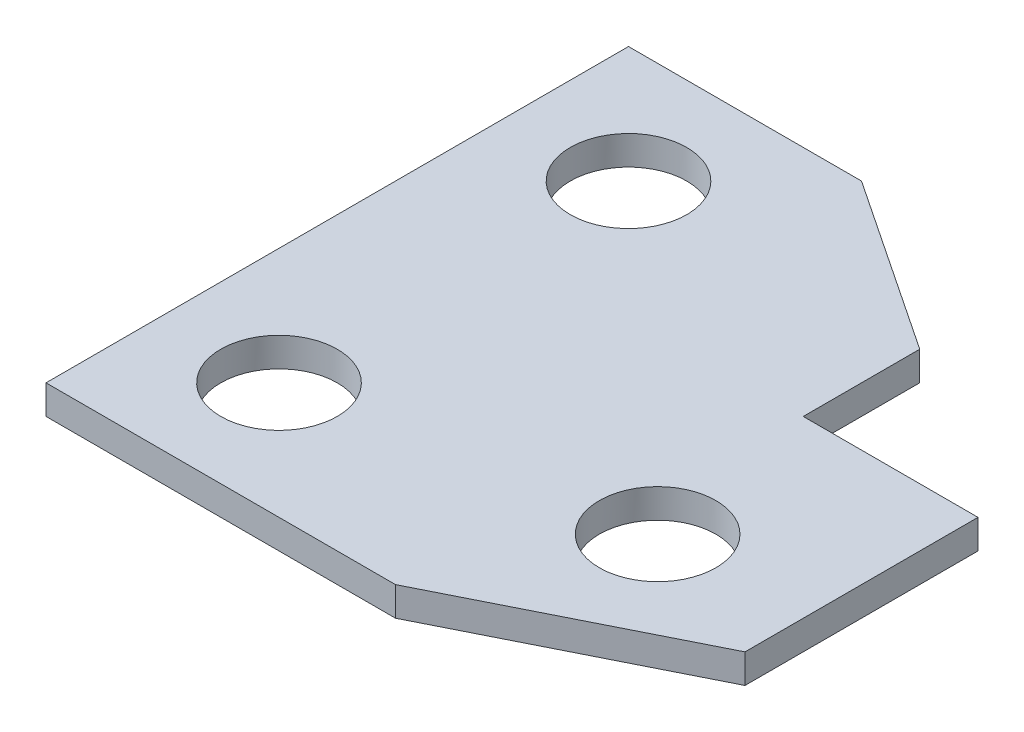
ISO-10303-21;
HEADER;
FILE_DESCRIPTION(('STEP AP214'),'2;1');
FILE_NAME('part.step','',(''),(''),'','','');
FILE_SCHEMA(('AUTOMOTIVE_DESIGN { 1 0 10303 214 1 1 1 1 }'));
ENDSEC;
DATA;
#1=APPLICATION_CONTEXT('core data for automotive mechanical design processes');
#2=APPLICATION_PROTOCOL_DEFINITION('international standard','automotive_design',2000,#1);
#3=PRODUCT_CONTEXT('',#1,'mechanical');
#4=PRODUCT('Part','Part','',(#3));
#5=PRODUCT_RELATED_PRODUCT_CATEGORY('part','',(#4));
#6=PRODUCT_DEFINITION_FORMATION('','',#4);
#7=PRODUCT_DEFINITION_CONTEXT('part definition',#1,'design');
#8=PRODUCT_DEFINITION('design','',#6,#7);
#9=PRODUCT_DEFINITION_SHAPE('','',#8);
#10=(LENGTH_UNIT() NAMED_UNIT(*) SI_UNIT(.MILLI.,.METRE.));
#11=(NAMED_UNIT(*) PLANE_ANGLE_UNIT() SI_UNIT($,.RADIAN.));
#12=(NAMED_UNIT(*) SI_UNIT($,.STERADIAN.) SOLID_ANGLE_UNIT());
#13=UNCERTAINTY_MEASURE_WITH_UNIT(LENGTH_MEASURE(1.E-05),#10,'distance_accuracy_value','');
#14=(GEOMETRIC_REPRESENTATION_CONTEXT(3) GLOBAL_UNCERTAINTY_ASSIGNED_CONTEXT((#13)) GLOBAL_UNIT_ASSIGNED_CONTEXT((#10,
#11,#12)) REPRESENTATION_CONTEXT('',''));
#15=CARTESIAN_POINT('',(0.,0.,0.));
#16=DIRECTION('',(0.,0.,1.));
#17=DIRECTION('',(1.,0.,0.));
#18=AXIS2_PLACEMENT_3D('',#15,#16,#17);
#19=CARTESIAN_POINT('',(72.8358998807466,5.,8.85943655601248));
#20=DIRECTION('',(0.,0.,1.));
#21=DIRECTION('',(1.,0.,0.));
#22=AXIS2_PLACEMENT_3D('',#19,#20,#21);
#23=PLANE('',#22);
#24=DIRECTION('',(-1.,0.,0.));
#25=VECTOR('',#24,1.);
#26=CARTESIAN_POINT('',(72.8358998807466,0.,8.85943655601248));
#27=LINE('',#26,#25);
#28=CARTESIAN_POINT('',(72.8358998807466,0.,8.85943655601248));
#29=VERTEX_POINT('',#28);
#30=CARTESIAN_POINT('',(42.8358998807466,0.,8.85943655601248));
#31=VERTEX_POINT('',#30);
#32=EDGE_CURVE('E145',#29,#31,#27,.T.);
#33=ORIENTED_EDGE('',*,*,#32,.T.);
#34=DIRECTION('',(0.,-1.,0.));
#35=VECTOR('',#34,1.);
#36=CARTESIAN_POINT('',(42.8358998807466,5.,8.85943655601248));
#37=LINE('',#36,#35);
#38=CARTESIAN_POINT('',(42.8358998807466,5.,8.85943655601248));
#39=VERTEX_POINT('',#38);
#40=EDGE_CURVE('E11',#39,#31,#37,.T.);
#41=ORIENTED_EDGE('',*,*,#40,.F.);
#42=DIRECTION('',(-1.,0.,0.));
#43=VECTOR('',#42,1.);
#44=CARTESIAN_POINT('',(72.8358998807466,5.,8.85943655601248));
#45=LINE('',#44,#43);
#46=CARTESIAN_POINT('',(72.8358998807466,5.,8.85943655601248));
#47=VERTEX_POINT('',#46);
#48=EDGE_CURVE('E167',#47,#39,#45,.T.);
#49=ORIENTED_EDGE('',*,*,#48,.F.);
#50=DIRECTION('',(0.,-1.,0.));
#51=VECTOR('',#50,1.);
#52=CARTESIAN_POINT('',(72.8358998807466,5.,8.85943655601248));
#53=LINE('',#52,#51);
#54=EDGE_CURVE('E141',#47,#29,#53,.T.);
#55=ORIENTED_EDGE('',*,*,#54,.T.);
#56=EDGE_LOOP('',(#33,#41,#49,#55));
#57=FACE_BOUND('',#56,.T.);
#58=ADVANCED_FACE('F42',(#57),#23,.F.);
#59=CARTESIAN_POINT('',(42.8358998807466,5.,8.85943655601248));
#60=DIRECTION('',(-1.,0.,0.));
#61=DIRECTION('',(0.,0.,1.));
#62=AXIS2_PLACEMENT_3D('',#59,#60,#61);
#63=PLANE('',#62);
#64=DIRECTION('',(0.,0.,-1.));
#65=VECTOR('',#64,1.);
#66=CARTESIAN_POINT('',(42.8358998807466,0.,8.85943655601248));
#67=LINE('',#66,#65);
#68=CARTESIAN_POINT('',(42.8358998807466,0.,-11.1405634439875));
#69=VERTEX_POINT('',#68);
#70=EDGE_CURVE('E149',#31,#69,#67,.T.);
#71=ORIENTED_EDGE('',*,*,#70,.T.);
#72=DIRECTION('',(0.,-1.,0.));
#73=VECTOR('',#72,1.);
#74=CARTESIAN_POINT('',(42.8358998807466,5.,-11.1405634439875));
#75=LINE('',#74,#73);
#76=CARTESIAN_POINT('',(42.8358998807466,5.,-11.1405634439875));
#77=VERTEX_POINT('',#76);
#78=EDGE_CURVE('E52',#77,#69,#75,.T.);
#79=ORIENTED_EDGE('',*,*,#78,.F.);
#80=DIRECTION('',(0.,0.,-1.));
#81=VECTOR('',#80,1.);
#82=CARTESIAN_POINT('',(42.8358998807466,5.,8.85943655601248));
#83=LINE('',#82,#81);
#84=EDGE_CURVE('E104',#39,#77,#83,.T.);
#85=ORIENTED_EDGE('',*,*,#84,.F.);
#86=ORIENTED_EDGE('',*,*,#40,.T.);
#87=EDGE_LOOP('',(#71,#79,#85,#86));
#88=FACE_BOUND('',#87,.T.);
#89=ADVANCED_FACE('F225',(#88),#63,.F.);
#90=CARTESIAN_POINT('',(42.8358998807466,5.,-11.1405634439875));
#91=DIRECTION('',(-0.554700196225229,0.,0.832050294337844));
#92=DIRECTION('',(0.832050294337844,0.,0.554700196225229));
#93=AXIS2_PLACEMENT_3D('',#90,#91,#92);
#94=PLANE('',#93);
#95=DIRECTION('',(-0.832050294337844,0.,-0.554700196225229));
#96=VECTOR('',#95,1.);
#97=CARTESIAN_POINT('',(42.8358998807466,0.,-11.1405634439875));
#98=LINE('',#97,#96);
#99=CARTESIAN_POINT('',(12.8358998807466,0.,-31.1405634439875));
#100=VERTEX_POINT('',#99);
#101=EDGE_CURVE('E152',#69,#100,#98,.T.);
#102=ORIENTED_EDGE('',*,*,#101,.T.);
#103=DIRECTION('',(0.,-1.,0.));
#104=VECTOR('',#103,1.);
#105=CARTESIAN_POINT('',(12.8358998807466,5.,-31.1405634439875));
#106=LINE('',#105,#104);
#107=CARTESIAN_POINT('',(12.8358998807466,5.,-31.1405634439875));
#108=VERTEX_POINT('',#107);
#109=EDGE_CURVE('E178',#108,#100,#106,.T.);
#110=ORIENTED_EDGE('',*,*,#109,.F.);
#111=DIRECTION('',(-0.832050294337844,0.,-0.554700196225229));
#112=VECTOR('',#111,1.);
#113=CARTESIAN_POINT('',(42.8358998807466,5.,-11.1405634439875));
#114=LINE('',#113,#112);
#115=EDGE_CURVE('E370',#77,#108,#114,.T.);
#116=ORIENTED_EDGE('',*,*,#115,.F.);
#117=ORIENTED_EDGE('',*,*,#78,.T.);
#118=EDGE_LOOP('',(#102,#110,#116,#117));
#119=FACE_BOUND('',#118,.T.);
#120=ADVANCED_FACE('F229',(#119),#94,.F.);
#121=CARTESIAN_POINT('',(12.8358998807466,5.,-31.1405634439875));
#122=DIRECTION('',(0.,0.,1.));
#123=DIRECTION('',(1.,0.,0.));
#124=AXIS2_PLACEMENT_3D('',#121,#122,#123);
#125=PLANE('',#124);
#126=DIRECTION('',(-1.,0.,0.));
#127=VECTOR('',#126,1.);
#128=CARTESIAN_POINT('',(12.8358998807466,0.,-31.1405634439875));
#129=LINE('',#128,#127);
#130=CARTESIAN_POINT('',(-27.1641001192534,0.,-31.1405634439875));
#131=VERTEX_POINT('',#130);
#132=EDGE_CURVE('E155',#100,#131,#129,.T.);
#133=ORIENTED_EDGE('',*,*,#132,.T.);
#134=DIRECTION('',(0.,-1.,0.));
#135=VECTOR('',#134,1.);
#136=CARTESIAN_POINT('',(-27.1641001192534,5.,-31.1405634439875));
#137=LINE('',#136,#135);
#138=CARTESIAN_POINT('',(-27.1641001192534,5.,-31.1405634439875));
#139=VERTEX_POINT('',#138);
#140=EDGE_CURVE('E174',#139,#131,#137,.T.);
#141=ORIENTED_EDGE('',*,*,#140,.F.);
#142=DIRECTION('',(-1.,0.,0.));
#143=VECTOR('',#142,1.);
#144=CARTESIAN_POINT('',(12.8358998807466,5.,-31.1405634439875));
#145=LINE('',#144,#143);
#146=EDGE_CURVE('E373',#108,#139,#145,.T.);
#147=ORIENTED_EDGE('',*,*,#146,.F.);
#148=ORIENTED_EDGE('',*,*,#109,.T.);
#149=EDGE_LOOP('',(#133,#141,#147,#148));
#150=FACE_BOUND('',#149,.T.);
#151=ADVANCED_FACE('F233',(#150),#125,.F.);
#152=CARTESIAN_POINT('',(-27.1641001192534,5.,-31.1405634439875));
#153=DIRECTION('',(1.,0.,0.));
#154=DIRECTION('',(0.,0.,-1.));
#155=AXIS2_PLACEMENT_3D('',#152,#153,#154);
#156=PLANE('',#155);
#157=DIRECTION('',(0.,0.,1.));
#158=VECTOR('',#157,1.);
#159=CARTESIAN_POINT('',(-27.1641001192534,0.,-31.1405634439875));
#160=LINE('',#159,#158);
#161=CARTESIAN_POINT('',(-27.1641001192534,0.,68.8594365560125));
#162=VERTEX_POINT('',#161);
#163=EDGE_CURVE('E158',#131,#162,#160,.T.);
#164=ORIENTED_EDGE('',*,*,#163,.T.);
#165=DIRECTION('',(0.,-1.,0.));
#166=VECTOR('',#165,1.);
#167=CARTESIAN_POINT('',(-27.1641001192534,5.,68.8594365560125));
#168=LINE('',#167,#166);
#169=CARTESIAN_POINT('',(-27.1641001192534,5.,68.8594365560125));
#170=VERTEX_POINT('',#169);
#171=EDGE_CURVE('E134',#170,#162,#168,.T.);
#172=ORIENTED_EDGE('',*,*,#171,.F.);
#173=DIRECTION('',(0.,0.,1.));
#174=VECTOR('',#173,1.);
#175=CARTESIAN_POINT('',(-27.1641001192534,5.,-31.1405634439875));
#176=LINE('',#175,#174);
#177=EDGE_CURVE('E123',#139,#170,#176,.T.);
#178=ORIENTED_EDGE('',*,*,#177,.F.);
#179=ORIENTED_EDGE('',*,*,#140,.T.);
#180=EDGE_LOOP('',(#164,#172,#178,#179));
#181=FACE_BOUND('',#180,.T.);
#182=ADVANCED_FACE('F239',(#181),#156,.F.);
#183=CARTESIAN_POINT('',(-27.1641001192534,5.,68.8594365560125));
#184=DIRECTION('',(0.,0.,-1.));
#185=DIRECTION('',(-1.,0.,0.));
#186=AXIS2_PLACEMENT_3D('',#183,#184,#185);
#187=PLANE('',#186);
#188=DIRECTION('',(1.,0.,0.));
#189=VECTOR('',#188,1.);
#190=CARTESIAN_POINT('',(-27.1641001192534,0.,68.8594365560125));
#191=LINE('',#190,#189);
#192=CARTESIAN_POINT('',(32.8358998807466,0.,68.8594365560125));
#193=VERTEX_POINT('',#192);
#194=EDGE_CURVE('E132',#162,#193,#191,.T.);
#195=ORIENTED_EDGE('',*,*,#194,.T.);
#196=DIRECTION('',(0.,-1.,0.));
#197=VECTOR('',#196,1.);
#198=CARTESIAN_POINT('',(32.8358998807466,5.,68.8594365560125));
#199=LINE('',#198,#197);
#200=CARTESIAN_POINT('',(32.8358998807466,5.,68.8594365560125));
#201=VERTEX_POINT('',#200);
#202=EDGE_CURVE('E129',#201,#193,#199,.T.);
#203=ORIENTED_EDGE('',*,*,#202,.F.);
#204=DIRECTION('',(1.,0.,0.));
#205=VECTOR('',#204,1.);
#206=CARTESIAN_POINT('',(-27.1641001192534,5.,68.8594365560125));
#207=LINE('',#206,#205);
#208=EDGE_CURVE('E117',#170,#201,#207,.T.);
#209=ORIENTED_EDGE('',*,*,#208,.F.);
#210=ORIENTED_EDGE('',*,*,#171,.T.);
#211=EDGE_LOOP('',(#195,#203,#209,#210));
#212=FACE_BOUND('',#211,.T.);
#213=ADVANCED_FACE('F130',(#212),#187,.F.);
#214=CARTESIAN_POINT('',(32.8358998807466,5.,68.8594365560125));
#215=DIRECTION('',(-0.447213595499958,0.,-0.894427190999916));
#216=DIRECTION('',(-0.894427190999916,0.,0.447213595499958));
#217=AXIS2_PLACEMENT_3D('',#214,#215,#216);
#218=PLANE('',#217);
#219=DIRECTION('',(0.894427190999916,0.,-0.447213595499958));
#220=VECTOR('',#219,1.);
#221=CARTESIAN_POINT('',(32.8358998807466,0.,68.8594365560125));
#222=LINE('',#221,#220);
#223=CARTESIAN_POINT('',(72.8358998807467,0.,48.8594365560125));
#224=VERTEX_POINT('',#223);
#225=EDGE_CURVE('E90',#193,#224,#222,.T.);
#226=ORIENTED_EDGE('',*,*,#225,.T.);
#227=DIRECTION('',(0.,-1.,0.));
#228=VECTOR('',#227,1.);
#229=CARTESIAN_POINT('',(72.8358998807467,5.,48.8594365560125));
#230=LINE('',#229,#228);
#231=CARTESIAN_POINT('',(72.8358998807467,5.,48.8594365560125));
#232=VERTEX_POINT('',#231);
#233=EDGE_CURVE('E135',#232,#224,#230,.T.);
#234=ORIENTED_EDGE('',*,*,#233,.F.);
#235=DIRECTION('',(0.894427190999916,0.,-0.447213595499958));
#236=VECTOR('',#235,1.);
#237=CARTESIAN_POINT('',(32.8358998807466,5.,68.8594365560125));
#238=LINE('',#237,#236);
#239=EDGE_CURVE('E121',#201,#232,#238,.T.);
#240=ORIENTED_EDGE('',*,*,#239,.F.);
#241=ORIENTED_EDGE('',*,*,#202,.T.);
#242=EDGE_LOOP('',(#226,#234,#240,#241));
#243=FACE_BOUND('',#242,.T.);
#244=ADVANCED_FACE('F137',(#243),#218,.F.);
#245=CARTESIAN_POINT('',(72.8358998807467,5.,48.8594365560125));
#246=DIRECTION('',(-1.,0.,0.));
#247=DIRECTION('',(0.,0.,1.));
#248=AXIS2_PLACEMENT_3D('',#245,#246,#247);
#249=PLANE('',#248);
#250=DIRECTION('',(0.,0.,-1.));
#251=VECTOR('',#250,1.);
#252=CARTESIAN_POINT('',(72.8358998807467,0.,48.8594365560125));
#253=LINE('',#252,#251);
#254=EDGE_CURVE('E96',#224,#29,#253,.T.);
#255=ORIENTED_EDGE('',*,*,#254,.T.);
#256=ORIENTED_EDGE('',*,*,#54,.F.);
#257=DIRECTION('',(0.,0.,-1.));
#258=VECTOR('',#257,1.);
#259=CARTESIAN_POINT('',(72.8358998807467,5.,48.8594365560125));
#260=LINE('',#259,#258);
#261=EDGE_CURVE('E61',#232,#47,#260,.T.);
#262=ORIENTED_EDGE('',*,*,#261,.F.);
#263=ORIENTED_EDGE('',*,*,#233,.T.);
#264=EDGE_LOOP('',(#255,#256,#262,#263));
#265=FACE_BOUND('',#264,.T.);
#266=ADVANCED_FACE('F214',(#265),#249,.F.);
#267=CARTESIAN_POINT('',(0.,5.,0.));
#268=DIRECTION('',(0.,-1.,0.));
#269=DIRECTION('',(0.,0.,-1.));
#270=AXIS2_PLACEMENT_3D('',#267,#268,#269);
#271=PLANE('',#270);
#272=CARTESIAN_POINT('',(-7.16410011925335,5.,-11.1405634439875));
#273=DIRECTION('',(0.,1.,0.));
#274=DIRECTION('',(0.,0.,1.));
#275=AXIS2_PLACEMENT_3D('',#272,#273,#274);
#276=CIRCLE('',#275,10.);
#277=CARTESIAN_POINT('',(-7.16410011925335,5.,-1.14056344398752));
#278=VERTEX_POINT('',#277);
#279=EDGE_CURVE('E189',#278,#278,#276,.T.);
#280=ORIENTED_EDGE('',*,*,#279,.F.);
#281=EDGE_LOOP('',(#280));
#282=FACE_BOUND('',#281,.T.);
#283=CARTESIAN_POINT('',(-7.16410011925336,5.,48.8594365560125));
#284=DIRECTION('',(0.,1.,0.));
#285=DIRECTION('',(0.,0.,1.));
#286=AXIS2_PLACEMENT_3D('',#283,#284,#285);
#287=CIRCLE('',#286,10.);
#288=CARTESIAN_POINT('',(-7.16410011925336,5.,58.8594365560125));
#289=VERTEX_POINT('',#288);
#290=EDGE_CURVE('E354',#289,#289,#287,.T.);
#291=ORIENTED_EDGE('',*,*,#290,.F.);
#292=EDGE_LOOP('',(#291));
#293=FACE_BOUND('',#292,.T.);
#294=CARTESIAN_POINT('',(47.8358998807466,5.,38.8594365560125));
#295=DIRECTION('',(0.,1.,0.));
#296=DIRECTION('',(0.,0.,1.));
#297=AXIS2_PLACEMENT_3D('',#294,#295,#296);
#298=CIRCLE('',#297,10.);
#299=CARTESIAN_POINT('',(47.8358998807466,5.,48.8594365560125));
#300=VERTEX_POINT('',#299);
#301=EDGE_CURVE('E357',#300,#300,#298,.T.);
#302=ORIENTED_EDGE('',*,*,#301,.F.);
#303=EDGE_LOOP('',(#302));
#304=FACE_BOUND('',#303,.T.);
#305=ORIENTED_EDGE('',*,*,#48,.T.);
#306=ORIENTED_EDGE('',*,*,#84,.T.);
#307=ORIENTED_EDGE('',*,*,#115,.T.);
#308=ORIENTED_EDGE('',*,*,#146,.T.);
#309=ORIENTED_EDGE('',*,*,#177,.T.);
#310=ORIENTED_EDGE('',*,*,#208,.T.);
#311=ORIENTED_EDGE('',*,*,#239,.T.);
#312=ORIENTED_EDGE('',*,*,#261,.T.);
#313=EDGE_LOOP('',(#305,#306,#307,#308,#309,#310,#311,#312));
#314=FACE_BOUND('',#313,.T.);
#315=ADVANCED_FACE('F119',(#282,#293,#304,#314),#271,.F.);
#316=CARTESIAN_POINT('',(0.,0.,0.));
#317=DIRECTION('',(0.,-1.,0.));
#318=DIRECTION('',(0.,0.,-1.));
#319=AXIS2_PLACEMENT_3D('',#316,#317,#318);
#320=PLANE('',#319);
#321=CARTESIAN_POINT('',(-7.16410011925335,0.,-11.1405634439875));
#322=DIRECTION('',(0.,-1.,0.));
#323=DIRECTION('',(0.,0.,-1.));
#324=AXIS2_PLACEMENT_3D('',#321,#322,#323);
#325=CIRCLE('',#324,10.);
#326=CARTESIAN_POINT('',(-7.16410011925335,0.,-21.1405634439875));
#327=VERTEX_POINT('',#326);
#328=EDGE_CURVE('E45',#327,#327,#325,.T.);
#329=ORIENTED_EDGE('',*,*,#328,.F.);
#330=EDGE_LOOP('',(#329));
#331=FACE_BOUND('',#330,.T.);
#332=CARTESIAN_POINT('',(-7.16410011925336,0.,48.8594365560125));
#333=DIRECTION('',(0.,-1.,0.));
#334=DIRECTION('',(0.,0.,-1.));
#335=AXIS2_PLACEMENT_3D('',#332,#333,#334);
#336=CIRCLE('',#335,10.);
#337=CARTESIAN_POINT('',(-7.16410011925336,0.,38.8594365560125));
#338=VERTEX_POINT('',#337);
#339=EDGE_CURVE('E188',#338,#338,#336,.T.);
#340=ORIENTED_EDGE('',*,*,#339,.F.);
#341=EDGE_LOOP('',(#340));
#342=FACE_BOUND('',#341,.T.);
#343=CARTESIAN_POINT('',(47.8358998807466,0.,38.8594365560125));
#344=DIRECTION('',(0.,-1.,0.));
#345=DIRECTION('',(0.,0.,-1.));
#346=AXIS2_PLACEMENT_3D('',#343,#344,#345);
#347=CIRCLE('',#346,10.);
#348=CARTESIAN_POINT('',(47.8358998807466,0.,28.8594365560125));
#349=VERTEX_POINT('',#348);
#350=EDGE_CURVE('E185',#349,#349,#347,.T.);
#351=ORIENTED_EDGE('',*,*,#350,.F.);
#352=EDGE_LOOP('',(#351));
#353=FACE_BOUND('',#352,.T.);
#354=ORIENTED_EDGE('',*,*,#32,.F.);
#355=ORIENTED_EDGE('',*,*,#254,.F.);
#356=ORIENTED_EDGE('',*,*,#225,.F.);
#357=ORIENTED_EDGE('',*,*,#194,.F.);
#358=ORIENTED_EDGE('',*,*,#163,.F.);
#359=ORIENTED_EDGE('',*,*,#132,.F.);
#360=ORIENTED_EDGE('',*,*,#101,.F.);
#361=ORIENTED_EDGE('',*,*,#70,.F.);
#362=EDGE_LOOP('',(#354,#355,#356,#357,#358,#359,#360,#361));
#363=FACE_BOUND('',#362,.T.);
#364=ADVANCED_FACE('F201',(#331,#342,#353,#363),#320,.T.);
#365=CARTESIAN_POINT('',(47.8358998807466,-1.2E-05,38.8594365560125));
#366=DIRECTION('',(0.,1.,0.));
#367=DIRECTION('',(0.,0.,1.));
#368=AXIS2_PLACEMENT_3D('',#365,#366,#367);
#369=CYLINDRICAL_SURFACE('',#368,10.);
#370=ORIENTED_EDGE('',*,*,#350,.T.);
#371=EDGE_LOOP('',(#370));
#372=FACE_BOUND('',#371,.T.);
#373=ORIENTED_EDGE('',*,*,#301,.T.);
#374=EDGE_LOOP('',(#373));
#375=FACE_BOUND('',#374,.T.);
#376=ADVANCED_FACE('F204',(#372,#375),#369,.F.);
#377=CARTESIAN_POINT('',(-7.16410011925336,-1.2E-05,48.8594365560125));
#378=DIRECTION('',(0.,1.,0.));
#379=DIRECTION('',(0.,0.,1.));
#380=AXIS2_PLACEMENT_3D('',#377,#378,#379);
#381=CYLINDRICAL_SURFACE('',#380,10.);
#382=ORIENTED_EDGE('',*,*,#339,.T.);
#383=EDGE_LOOP('',(#382));
#384=FACE_BOUND('',#383,.T.);
#385=ORIENTED_EDGE('',*,*,#290,.T.);
#386=EDGE_LOOP('',(#385));
#387=FACE_BOUND('',#386,.T.);
#388=ADVANCED_FACE('F282',(#384,#387),#381,.F.);
#389=CARTESIAN_POINT('',(-7.16410011925335,-1.2E-05,-11.1405634439875));
#390=DIRECTION('',(0.,1.,0.));
#391=DIRECTION('',(0.,0.,1.));
#392=AXIS2_PLACEMENT_3D('',#389,#390,#391);
#393=CYLINDRICAL_SURFACE('',#392,10.);
#394=ORIENTED_EDGE('',*,*,#328,.T.);
#395=EDGE_LOOP('',(#394));
#396=FACE_BOUND('',#395,.T.);
#397=ORIENTED_EDGE('',*,*,#279,.T.);
#398=EDGE_LOOP('',(#397));
#399=FACE_BOUND('',#398,.T.);
#400=ADVANCED_FACE('F198',(#396,#399),#393,.F.);
#401=CLOSED_SHELL('',(#58,#89,#120,#151,#182,#213,#244,#266,#315,#364,#376,#388,#400));
#402=MANIFOLD_SOLID_BREP('B2',#401);
#403=ADVANCED_BREP_SHAPE_REPRESENTATION('',(#18,#402),#14);
#404=SHAPE_DEFINITION_REPRESENTATION(#9,#403);
ENDSEC;
END-ISO-10303-21;
